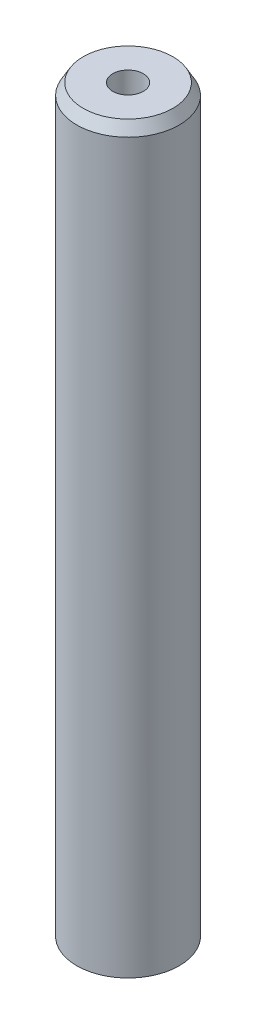
ISO-10303-21;
HEADER;
FILE_DESCRIPTION(('STEP AP214'),'2;1');
FILE_NAME('part.step','',(''),(''),'','','');
FILE_SCHEMA(('AUTOMOTIVE_DESIGN { 1 0 10303 214 1 1 1 1 }'));
ENDSEC;
DATA;
#1=APPLICATION_CONTEXT('core data for automotive mechanical design processes');
#2=APPLICATION_PROTOCOL_DEFINITION('international standard','automotive_design',2000,#1);
#3=PRODUCT_CONTEXT('',#1,'mechanical');
#4=PRODUCT('Part','Part','',(#3));
#5=PRODUCT_RELATED_PRODUCT_CATEGORY('part','',(#4));
#6=PRODUCT_DEFINITION_FORMATION('','',#4);
#7=PRODUCT_DEFINITION_CONTEXT('part definition',#1,'design');
#8=PRODUCT_DEFINITION('design','',#6,#7);
#9=PRODUCT_DEFINITION_SHAPE('','',#8);
#10=(LENGTH_UNIT() NAMED_UNIT(*) SI_UNIT(.MILLI.,.METRE.));
#11=(NAMED_UNIT(*) PLANE_ANGLE_UNIT() SI_UNIT($,.RADIAN.));
#12=(NAMED_UNIT(*) SI_UNIT($,.STERADIAN.) SOLID_ANGLE_UNIT());
#13=UNCERTAINTY_MEASURE_WITH_UNIT(LENGTH_MEASURE(1.E-05),#10,'distance_accuracy_value','');
#14=(GEOMETRIC_REPRESENTATION_CONTEXT(3) GLOBAL_UNCERTAINTY_ASSIGNED_CONTEXT((#13)) GLOBAL_UNIT_ASSIGNED_CONTEXT((#10,
#11,#12)) REPRESENTATION_CONTEXT('',''));
#15=CARTESIAN_POINT('',(0.,0.,0.));
#16=DIRECTION('',(0.,0.,1.));
#17=DIRECTION('',(1.,0.,0.));
#18=AXIS2_PLACEMENT_3D('',#15,#16,#17);
#19=CARTESIAN_POINT('',(0.,181.878522232665,0.));
#20=DIRECTION('',(0.,-1.,0.));
#21=DIRECTION('',(0.,0.,-1.));
#22=AXIS2_PLACEMENT_3D('',#19,#20,#21);
#23=CYLINDRICAL_SURFACE('',#22,12.5);
#24=CARTESIAN_POINT('',(0.,179.152964916647,0.));
#25=DIRECTION('',(0.,1.,0.));
#26=DIRECTION('',(0.,0.,1.));
#27=AXIS2_PLACEMENT_3D('',#24,#25,#26);
#28=CIRCLE('',#27,12.5);
#29=CARTESIAN_POINT('',(0.,179.152964916647,-12.5));
#30=VERTEX_POINT('',#29);
#31=EDGE_CURVE('E50',#30,#30,#28,.F.);
#32=CARTESIAN_POINT('',(0.,1.57360125009487,0.));
#33=DIRECTION('',(0.,1.,0.));
#34=DIRECTION('',(0.,0.,1.));
#35=AXIS2_PLACEMENT_3D('',#32,#33,#34);
#36=CIRCLE('',#35,12.5);
#37=CARTESIAN_POINT('',(0.,1.57360125009484,-12.5));
#38=VERTEX_POINT('',#37);
#39=EDGE_CURVE('E51',#38,#38,#36,.T.);
#40=CARTESIAN_POINT('',(0.,179.152964916647,-12.5));
#41=CARTESIAN_POINT('',(0.,177.303179878454,-12.5));
#42=CARTESIAN_POINT('',(0.,175.45339484026,-12.5));
#43=CARTESIAN_POINT('',(0.,171.753824763874,-12.5));
#44=CARTESIAN_POINT('',(0.,169.904039725681,-12.5));
#45=CARTESIAN_POINT('',(0.,166.204469649294,-12.5));
#46=CARTESIAN_POINT('',(0.,164.354684611101,-12.5));
#47=CARTESIAN_POINT('',(0.,160.655114534714,-12.5));
#48=CARTESIAN_POINT('',(0.,158.805329496521,-12.5));
#49=CARTESIAN_POINT('',(0.,155.105759420135,-12.5));
#50=CARTESIAN_POINT('',(0.,153.255974381941,-12.5));
#51=CARTESIAN_POINT('',(0.,149.556404305555,-12.5));
#52=CARTESIAN_POINT('',(0.,147.706619267362,-12.5));
#53=CARTESIAN_POINT('',(0.,144.007049190975,-12.5));
#54=CARTESIAN_POINT('',(0.,142.157264152782,-12.5));
#55=CARTESIAN_POINT('',(0.,138.457694076395,-12.5));
#56=CARTESIAN_POINT('',(0.,136.607909038202,-12.5));
#57=CARTESIAN_POINT('',(0.,132.908338961816,-12.5));
#58=CARTESIAN_POINT('',(0.,131.058553923622,-12.5));
#59=CARTESIAN_POINT('',(0.,127.358983847236,-12.5));
#60=CARTESIAN_POINT('',(0.,125.509198809043,-12.5));
#61=CARTESIAN_POINT('',(0.,121.809628732656,-12.5));
#62=CARTESIAN_POINT('',(0.,119.959843694463,-12.5));
#63=CARTESIAN_POINT('',(0.,116.260273618076,-12.5));
#64=CARTESIAN_POINT('',(0.,114.410488579883,-12.5));
#65=CARTESIAN_POINT('',(0.,110.710918503497,-12.5));
#66=CARTESIAN_POINT('',(0.,108.861133465303,-12.5));
#67=CARTESIAN_POINT('',(0.,105.161563388917,-12.5));
#68=CARTESIAN_POINT('',(0.,103.311778350724,-12.5));
#69=CARTESIAN_POINT('',(0.,99.6122082743371,-12.5));
#70=CARTESIAN_POINT('',(0.,97.7624232361439,-12.5));
#71=CARTESIAN_POINT('',(0.,94.0628531597574,-12.5));
#72=CARTESIAN_POINT('',(0.,92.2130681215641,-12.5));
#73=CARTESIAN_POINT('',(0.,88.5134980451776,-12.5));
#74=CARTESIAN_POINT('',(0.,86.6637130069844,-12.5));
#75=CARTESIAN_POINT('',(0.,82.9641429305979,-12.5));
#76=CARTESIAN_POINT('',(0.,81.1143578924046,-12.5));
#77=CARTESIAN_POINT('',(0.,77.4147878160181,-12.5));
#78=CARTESIAN_POINT('',(0.,75.5650027778249,-12.5));
#79=CARTESIAN_POINT('',(0.,71.8654327014384,-12.5));
#80=CARTESIAN_POINT('',(0.,70.0156476632451,-12.5));
#81=CARTESIAN_POINT('',(0.,66.3160775868586,-12.5));
#82=CARTESIAN_POINT('',(0.,64.4662925486654,-12.5));
#83=CARTESIAN_POINT('',(0.,60.7667224722789,-12.5));
#84=CARTESIAN_POINT('',(0.,58.9169374340856,-12.5));
#85=CARTESIAN_POINT('',(0.,55.2173673576991,-12.5));
#86=CARTESIAN_POINT('',(0.,53.3675823195059,-12.5));
#87=CARTESIAN_POINT('',(0.,49.6680122431194,-12.5));
#88=CARTESIAN_POINT('',(0.,47.8182272049261,-12.5));
#89=CARTESIAN_POINT('',(0.,44.1186571285396,-12.5));
#90=CARTESIAN_POINT('',(0.,42.2688720903464,-12.5));
#91=CARTESIAN_POINT('',(0.,38.5693020139599,-12.5));
#92=CARTESIAN_POINT('',(0.,36.7195169757666,-12.5));
#93=CARTESIAN_POINT('',(0.,33.0199468993801,-12.5));
#94=CARTESIAN_POINT('',(0.,31.1701618611868,-12.5));
#95=CARTESIAN_POINT('',(0.,27.4705917848004,-12.5));
#96=CARTESIAN_POINT('',(0.,25.6208067466071,-12.5));
#97=CARTESIAN_POINT('',(0.,21.9212366702206,-12.5));
#98=CARTESIAN_POINT('',(0.,20.0714516320273,-12.5));
#99=CARTESIAN_POINT('',(0.,16.3718815556408,-12.5));
#100=CARTESIAN_POINT('',(0.,14.5220965174476,-12.5));
#101=CARTESIAN_POINT('',(0.,10.8225264410611,-12.5));
#102=CARTESIAN_POINT('',(0.,8.97274140286784,-12.5));
#103=CARTESIAN_POINT('',(0.,5.27317132648133,-12.5));
#104=CARTESIAN_POINT('',(0.,3.42338628828809,-12.5));
#105=CARTESIAN_POINT('',(0.,1.57360125009484,-12.5));
#106=B_SPLINE_CURVE_WITH_KNOTS('',3,(#40,#41,#42,#43,#44,#45,#46,#47,#48,#49,#50,#51,#52,#53,
#54,#55,#56,#57,#58,#59,#60,#61,#62,#63,#64,#65,#66,#67,#68,#69,#70,#71,#72,#73,#74,#75,#76,#77,
#78,#79,#80,#81,#82,#83,#84,#85,#86,#87,#88,#89,#90,#91,#92,#93,#94,#95,#96,#97,#98,#99,#100,
#101,#102,#103,#104,#105),.UNSPECIFIED.,.F.,.F.,(4,2,2,2,2,2,2,2,2,2,2,2,2,2,2,2,2,2,2,2,2,2,2,
2,2,2,2,2,2,2,2,2,4),(0.,5.54935511457974,11.0987102291595,16.6480653437392,22.197420458319,
27.7467755728987,33.2961306874785,38.8454858020582,44.394840916638,49.9441960312177,
55.4935511457975,61.0429062603772,66.592261374957,72.1416164895367,77.6909716041165,
83.2403267186962,88.789681833276,94.3390369478558,99.8883920624355,105.437747177015,
110.987102291595,116.536457406175,122.085812520755,127.635167635334,133.184522749914,
138.733877864494,144.283232979074,149.832588093653,155.381943208233,160.931298322813,
166.480653437393,172.030008551972,177.579363666552),.UNSPECIFIED.);
#107=EDGE_CURVE('BSEAM39',#30,#38,#106,.T.);
#108=ORIENTED_EDGE('',*,*,#31,.T.);
#109=ORIENTED_EDGE('',*,*,#39,.T.);
#110=ORIENTED_EDGE('',*,*,#107,.T.);
#111=ORIENTED_EDGE('',*,*,#107,.F.);
#112=EDGE_LOOP('',(#108,#110,#109,#111));
#113=FACE_BOUND('',#112,.T.);
#114=ADVANCED_FACE('F39',(#113),#23,.T.);
#115=CARTESIAN_POINT('',(0.,181.878522232665,0.));
#116=DIRECTION('',(0.,1.,0.));
#117=DIRECTION('',(0.,0.,1.));
#118=AXIS2_PLACEMENT_3D('',#115,#116,#117);
#119=PLANE('',#118);
#120=CARTESIAN_POINT('',(0.,181.878522232665,0.));
#121=DIRECTION('',(0.,1.,0.));
#122=DIRECTION('',(0.,0.,1.));
#123=AXIS2_PLACEMENT_3D('',#120,#121,#122);
#124=CIRCLE('',#123,10.9263987499053);
#125=CARTESIAN_POINT('',(0.,181.878522232665,10.9263987499053));
#126=VERTEX_POINT('',#125);
#127=EDGE_CURVE('E54',#126,#126,#124,.T.);
#128=ORIENTED_EDGE('',*,*,#127,.T.);
#129=EDGE_LOOP('',(#128));
#130=FACE_BOUND('',#129,.T.);
#131=CARTESIAN_POINT('',(0.,181.878522232665,0.));
#132=DIRECTION('',(0.,1.,0.));
#133=DIRECTION('',(0.,0.,1.));
#134=AXIS2_PLACEMENT_3D('',#131,#132,#133);
#135=CIRCLE('',#134,3.73709678454785);
#136=CARTESIAN_POINT('',(0.,181.878522232665,-3.73709678454785));
#137=VERTEX_POINT('',#136);
#138=EDGE_CURVE('E58',#137,#137,#135,.T.);
#139=ORIENTED_EDGE('',*,*,#138,.F.);
#140=EDGE_LOOP('',(#139));
#141=FACE_BOUND('',#140,.T.);
#142=ADVANCED_FACE('F69',(#130,#141),#119,.T.);
#143=CARTESIAN_POINT('',(0.,0.,0.));
#144=DIRECTION('',(0.,1.,0.));
#145=DIRECTION('',(0.,0.,1.));
#146=AXIS2_PLACEMENT_3D('',#143,#144,#145);
#147=PLANE('',#146);
#148=CARTESIAN_POINT('',(0.,0.,0.));
#149=DIRECTION('',(0.,1.,0.));
#150=DIRECTION('',(0.,0.,1.));
#151=AXIS2_PLACEMENT_3D('',#148,#149,#150);
#152=CIRCLE('',#151,9.77444268398175);
#153=CARTESIAN_POINT('',(0.,0.,9.77444268398175));
#154=VERTEX_POINT('',#153);
#155=EDGE_CURVE('E10',#154,#154,#152,.F.);
#156=ORIENTED_EDGE('',*,*,#155,.T.);
#157=EDGE_LOOP('',(#156));
#158=FACE_BOUND('',#157,.T.);
#159=CARTESIAN_POINT('',(0.,0.,0.));
#160=DIRECTION('',(0.,1.,0.));
#161=DIRECTION('',(0.,0.,1.));
#162=AXIS2_PLACEMENT_3D('',#159,#160,#161);
#163=CIRCLE('',#162,3.73709678454785);
#164=CARTESIAN_POINT('',(0.,0.,-3.73709678454785));
#165=VERTEX_POINT('',#164);
#166=EDGE_CURVE('E63',#165,#165,#163,.T.);
#167=ORIENTED_EDGE('',*,*,#166,.T.);
#168=EDGE_LOOP('',(#167));
#169=FACE_BOUND('',#168,.T.);
#170=ADVANCED_FACE('F75',(#158,#169),#147,.F.);
#171=CARTESIAN_POINT('',(0.,181.878522232665,0.));
#172=DIRECTION('',(0.,-1.,0.));
#173=DIRECTION('',(0.,0.,-1.));
#174=AXIS2_PLACEMENT_3D('',#171,#172,#173);
#175=CYLINDRICAL_SURFACE('',#174,3.73709678454785);
#176=CARTESIAN_POINT('',(0.,181.878522232665,-3.73709678454785));
#177=CARTESIAN_POINT('',(0.,179.983954292741,-3.73709678454785));
#178=CARTESIAN_POINT('',(0.,178.089386352818,-3.73709678454785));
#179=CARTESIAN_POINT('',(0.,174.30025047297,-3.73709678454785));
#180=CARTESIAN_POINT('',(0.,172.405682533047,-3.73709678454785));
#181=CARTESIAN_POINT('',(0.,168.6165466532,-3.73709678454785));
#182=CARTESIAN_POINT('',(0.,166.721978713276,-3.73709678454785));
#183=CARTESIAN_POINT('',(0.,162.932842833429,-3.73709678454785));
#184=CARTESIAN_POINT('',(0.,161.038274893505,-3.73709678454785));
#185=CARTESIAN_POINT('',(0.,157.249139013658,-3.73709678454785));
#186=CARTESIAN_POINT('',(0.,155.354571073735,-3.73709678454785));
#187=CARTESIAN_POINT('',(0.,151.565435193887,-3.73709678454785));
#188=CARTESIAN_POINT('',(0.,149.670867253964,-3.73709678454785));
#189=CARTESIAN_POINT('',(0.,145.881731374117,-3.73709678454785));
#190=CARTESIAN_POINT('',(0.,143.987163434193,-3.73709678454785));
#191=CARTESIAN_POINT('',(0.,140.198027554346,-3.73709678454785));
#192=CARTESIAN_POINT('',(0.,138.303459614422,-3.73709678454785));
#193=CARTESIAN_POINT('',(0.,134.514323734575,-3.73709678454785));
#194=CARTESIAN_POINT('',(0.,132.619755794651,-3.73709678454785));
#195=CARTESIAN_POINT('',(0.,128.830619914804,-3.73709678454785));
#196=CARTESIAN_POINT('',(0.,126.936051974881,-3.73709678454785));
#197=CARTESIAN_POINT('',(0.,123.146916095033,-3.73709678454785));
#198=CARTESIAN_POINT('',(0.,121.25234815511,-3.73709678454785));
#199=CARTESIAN_POINT('',(0.,117.463212275263,-3.73709678454785));
#200=CARTESIAN_POINT('',(0.,115.568644335339,-3.73709678454785));
#201=CARTESIAN_POINT('',(0.,111.779508455492,-3.73709678454785));
#202=CARTESIAN_POINT('',(0.,109.884940515568,-3.73709678454785));
#203=CARTESIAN_POINT('',(0.,106.095804635721,-3.73709678454785));
#204=CARTESIAN_POINT('',(0.,104.201236695798,-3.73709678454785));
#205=CARTESIAN_POINT('',(0.,100.41210081595,-3.73709678454785));
#206=CARTESIAN_POINT('',(0.,98.5175328760268,-3.73709678454785));
#207=CARTESIAN_POINT('',(0.,94.7283969961796,-3.73709678454785));
#208=CARTESIAN_POINT('',(0.,92.833829056256,-3.73709678454785));
#209=CARTESIAN_POINT('',(0.,89.0446931764088,-3.73709678454785));
#210=CARTESIAN_POINT('',(0.,87.1501252364852,-3.73709678454785));
#211=CARTESIAN_POINT('',(0.,83.360989356638,-3.73709678454785));
#212=CARTESIAN_POINT('',(0.,81.4664214167145,-3.73709678454785));
#213=CARTESIAN_POINT('',(0.,77.6772855368673,-3.73709678454785));
#214=CARTESIAN_POINT('',(0.,75.7827175969437,-3.73709678454785));
#215=CARTESIAN_POINT('',(0.,71.9935817170965,-3.73709678454785));
#216=CARTESIAN_POINT('',(0.,70.0990137771729,-3.73709678454785));
#217=CARTESIAN_POINT('',(0.,66.3098778973257,-3.73709678454785));
#218=CARTESIAN_POINT('',(0.,64.4153099574021,-3.73709678454785));
#219=CARTESIAN_POINT('',(0.,60.6261740775549,-3.73709678454785));
#220=CARTESIAN_POINT('',(0.,58.7316061376314,-3.73709678454785));
#221=CARTESIAN_POINT('',(0.,54.9424702577842,-3.73709678454785));
#222=CARTESIAN_POINT('',(0.,53.0479023178606,-3.73709678454785));
#223=CARTESIAN_POINT('',(0.,49.2587664380134,-3.73709678454785));
#224=CARTESIAN_POINT('',(0.,47.3641984980898,-3.73709678454785));
#225=CARTESIAN_POINT('',(0.,43.5750626182426,-3.73709678454785));
#226=CARTESIAN_POINT('',(0.,41.680494678319,-3.73709678454785));
#227=CARTESIAN_POINT('',(0.,37.8913587984718,-3.73709678454785));
#228=CARTESIAN_POINT('',(0.,35.9967908585482,-3.73709678454785));
#229=CARTESIAN_POINT('',(0.,32.207654978701,-3.73709678454785));
#230=CARTESIAN_POINT('',(0.,30.3130870387775,-3.73709678454785));
#231=CARTESIAN_POINT('',(0.,26.5239511589303,-3.73709678454785));
#232=CARTESIAN_POINT('',(0.,24.6293832190067,-3.73709678454785));
#233=CARTESIAN_POINT('',(0.,20.8402473391595,-3.73709678454785));
#234=CARTESIAN_POINT('',(0.,18.9456793992359,-3.73709678454785));
#235=CARTESIAN_POINT('',(0.,15.1565435193887,-3.73709678454785));
#236=CARTESIAN_POINT('',(0.,13.2619755794651,-3.73709678454785));
#237=CARTESIAN_POINT('',(0.,9.47283969961794,-3.73709678454785));
#238=CARTESIAN_POINT('',(0.,7.57827175969435,-3.73709678454785));
#239=CARTESIAN_POINT('',(0.,3.78913587984717,-3.73709678454785));
#240=CARTESIAN_POINT('',(0.,1.89456793992357,-3.73709678454785));
#241=CARTESIAN_POINT('',(0.,0.,-3.73709678454785));
#242=B_SPLINE_CURVE_WITH_KNOTS('',3,(#176,#177,#178,#179,#180,#181,#182,#183,#184,#185,#186,
#187,#188,#189,#190,#191,#192,#193,#194,#195,#196,#197,#198,#199,#200,#201,#202,#203,#204,#205,
#206,#207,#208,#209,#210,#211,#212,#213,#214,#215,#216,#217,#218,#219,#220,#221,#222,#223,#224,
#225,#226,#227,#228,#229,#230,#231,#232,#233,#234,#235,#236,#237,#238,#239,#240,#241),
.UNSPECIFIED.,.F.,.F.,(4,2,2,2,2,2,2,2,2,2,2,2,2,2,2,2,2,2,2,2,2,2,2,2,2,2,2,2,2,2,2,2,4),(0.,
5.68370381977079,11.3674076395416,17.0511114593123,22.7348152790831,28.4185190988539,
34.1022229186247,39.7859267383955,45.4696305581662,51.153334377937,56.8370381977078,
62.5207420174786,68.2044458372494,73.8881496570201,79.5718534767909,85.2555572965617,
90.9392611163325,96.6229649361032,102.306668755874,107.990372575645,113.674076395416,
119.357780215186,125.041484034957,130.725187854728,136.408891674499,142.092595494269,
147.77629931404,153.460003133811,159.143706953582,164.827410773353,170.511114593123,
176.194818412894,181.878522232665),.UNSPECIFIED.);
#243=EDGE_CURVE('BSEAM70',#137,#165,#242,.T.);
#244=ORIENTED_EDGE('',*,*,#138,.T.);
#245=ORIENTED_EDGE('',*,*,#166,.F.);
#246=ORIENTED_EDGE('',*,*,#243,.T.);
#247=ORIENTED_EDGE('',*,*,#243,.F.);
#248=EDGE_LOOP('',(#244,#246,#245,#247));
#249=FACE_BOUND('',#248,.T.);
#250=ADVANCED_FACE('F70',(#249),#175,.F.);
#251=CARTESIAN_POINT('',(0.,181.878522232665,0.));
#252=DIRECTION('',(0.,-1.,0.));
#253=DIRECTION('',(0.,0.,-1.));
#254=AXIS2_PLACEMENT_3D('',#251,#252,#253);
#255=CONICAL_SURFACE('',#254,10.9263987499053,0.523598775598299);
#256=ORIENTED_EDGE('',*,*,#31,.F.);
#257=EDGE_LOOP('',(#256));
#258=FACE_BOUND('',#257,.T.);
#259=ORIENTED_EDGE('',*,*,#127,.F.);
#260=EDGE_LOOP('',(#259));
#261=FACE_BOUND('',#260,.T.);
#262=ADVANCED_FACE('F81',(#258,#261),#255,.T.);
#263=CARTESIAN_POINT('',(0.,1.57360125009487,0.));
#264=DIRECTION('',(0.,1.,0.));
#265=DIRECTION('',(0.,0.,1.));
#266=AXIS2_PLACEMENT_3D('',#263,#264,#265);
#267=CONICAL_SURFACE('',#266,12.5,1.0471975511966);
#268=ORIENTED_EDGE('',*,*,#155,.F.);
#269=EDGE_LOOP('',(#268));
#270=FACE_BOUND('',#269,.T.);
#271=ORIENTED_EDGE('',*,*,#39,.F.);
#272=EDGE_LOOP('',(#271));
#273=FACE_BOUND('',#272,.T.);
#274=ADVANCED_FACE('F45',(#270,#273),#267,.T.);
#275=CLOSED_SHELL('',(#114,#142,#170,#250,#262,#274));
#276=MANIFOLD_SOLID_BREP('B2',#275);
#277=ADVANCED_BREP_SHAPE_REPRESENTATION('',(#18,#276),#14);
#278=SHAPE_DEFINITION_REPRESENTATION(#9,#277);
ENDSEC;
END-ISO-10303-21;
